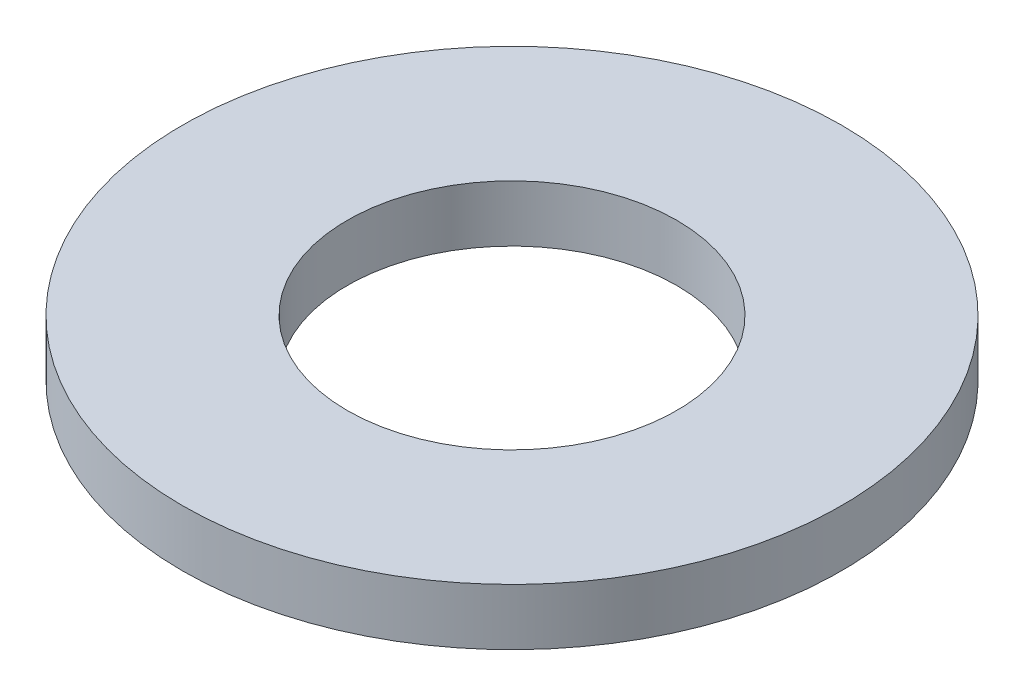
ISO-10303-21;
HEADER;
FILE_DESCRIPTION(('STEP AP214'),'2;1');
FILE_NAME('part.step','',(''),(''),'','','');
FILE_SCHEMA(('AUTOMOTIVE_DESIGN { 1 0 10303 214 1 1 1 1 }'));
ENDSEC;
DATA;
#1=APPLICATION_CONTEXT('core data for automotive mechanical design processes');
#2=APPLICATION_PROTOCOL_DEFINITION('international standard','automotive_design',2000,#1);
#3=PRODUCT_CONTEXT('',#1,'mechanical');
#4=PRODUCT('Part','Part','',(#3));
#5=PRODUCT_RELATED_PRODUCT_CATEGORY('part','',(#4));
#6=PRODUCT_DEFINITION_FORMATION('','',#4);
#7=PRODUCT_DEFINITION_CONTEXT('part definition',#1,'design');
#8=PRODUCT_DEFINITION('design','',#6,#7);
#9=PRODUCT_DEFINITION_SHAPE('','',#8);
#10=(LENGTH_UNIT() NAMED_UNIT(*) SI_UNIT(.MILLI.,.METRE.));
#11=(NAMED_UNIT(*) PLANE_ANGLE_UNIT() SI_UNIT($,.RADIAN.));
#12=(NAMED_UNIT(*) SI_UNIT($,.STERADIAN.) SOLID_ANGLE_UNIT());
#13=UNCERTAINTY_MEASURE_WITH_UNIT(LENGTH_MEASURE(1.E-05),#10,'distance_accuracy_value','');
#14=(GEOMETRIC_REPRESENTATION_CONTEXT(3) GLOBAL_UNCERTAINTY_ASSIGNED_CONTEXT((#13)) GLOBAL_UNIT_ASSIGNED_CONTEXT((#10,
#11,#12)) REPRESENTATION_CONTEXT('',''));
#15=CARTESIAN_POINT('',(0.,0.,0.));
#16=DIRECTION('',(0.,0.,1.));
#17=DIRECTION('',(1.,0.,0.));
#18=AXIS2_PLACEMENT_3D('',#15,#16,#17);
#19=CARTESIAN_POINT('',(0.,6.,0.));
#20=DIRECTION('',(0.,1.,0.));
#21=DIRECTION('',(0.,0.,1.));
#22=AXIS2_PLACEMENT_3D('',#19,#20,#21);
#23=PLANE('',#22);
#24=CARTESIAN_POINT('',(0.,6.,0.));
#25=DIRECTION('',(0.,1.,0.));
#26=DIRECTION('',(0.,0.,1.));
#27=AXIS2_PLACEMENT_3D('',#24,#25,#26);
#28=CIRCLE('',#27,35.);
#29=CARTESIAN_POINT('',(0.,6.,35.));
#30=VERTEX_POINT('',#29);
#31=EDGE_CURVE('E10',#30,#30,#28,.T.);
#32=ORIENTED_EDGE('',*,*,#31,.T.);
#33=EDGE_LOOP('',(#32));
#34=FACE_BOUND('',#33,.T.);
#35=CARTESIAN_POINT('',(0.,6.,0.));
#36=DIRECTION('',(0.,1.,0.));
#37=DIRECTION('',(0.,0.,1.));
#38=AXIS2_PLACEMENT_3D('',#35,#36,#37);
#39=CIRCLE('',#38,17.5);
#40=CARTESIAN_POINT('',(0.,6.,17.5));
#41=VERTEX_POINT('',#40);
#42=EDGE_CURVE('E40',#41,#41,#39,.T.);
#43=ORIENTED_EDGE('',*,*,#42,.F.);
#44=EDGE_LOOP('',(#43));
#45=FACE_BOUND('',#44,.T.);
#46=ADVANCED_FACE('F29',(#34,#45),#23,.T.);
#47=CARTESIAN_POINT('',(0.,0.,0.));
#48=DIRECTION('',(0.,1.,0.));
#49=DIRECTION('',(0.,0.,1.));
#50=AXIS2_PLACEMENT_3D('',#47,#48,#49);
#51=PLANE('',#50);
#52=CARTESIAN_POINT('',(0.,0.,0.));
#53=DIRECTION('',(0.,1.,0.));
#54=DIRECTION('',(0.,0.,1.));
#55=AXIS2_PLACEMENT_3D('',#52,#53,#54);
#56=CIRCLE('',#55,35.);
#57=CARTESIAN_POINT('',(0.,0.,35.));
#58=VERTEX_POINT('',#57);
#59=EDGE_CURVE('E33',#58,#58,#56,.T.);
#60=ORIENTED_EDGE('',*,*,#59,.F.);
#61=EDGE_LOOP('',(#60));
#62=FACE_BOUND('',#61,.T.);
#63=CARTESIAN_POINT('',(0.,0.,0.));
#64=DIRECTION('',(0.,1.,0.));
#65=DIRECTION('',(0.,0.,1.));
#66=AXIS2_PLACEMENT_3D('',#63,#64,#65);
#67=CIRCLE('',#66,17.5);
#68=CARTESIAN_POINT('',(0.,0.,17.5));
#69=VERTEX_POINT('',#68);
#70=EDGE_CURVE('E42',#69,#69,#67,.T.);
#71=ORIENTED_EDGE('',*,*,#70,.T.);
#72=EDGE_LOOP('',(#71));
#73=FACE_BOUND('',#72,.T.);
#74=ADVANCED_FACE('F52',(#62,#73),#51,.F.);
#75=CARTESIAN_POINT('',(0.,6.,0.));
#76=DIRECTION('',(0.,-1.,0.));
#77=DIRECTION('',(0.,0.,-1.));
#78=AXIS2_PLACEMENT_3D('',#75,#76,#77);
#79=CYLINDRICAL_SURFACE('',#78,35.);
#80=ORIENTED_EDGE('',*,*,#31,.F.);
#81=EDGE_LOOP('',(#80));
#82=FACE_BOUND('',#81,.T.);
#83=ORIENTED_EDGE('',*,*,#59,.T.);
#84=EDGE_LOOP('',(#83));
#85=FACE_BOUND('',#84,.T.);
#86=ADVANCED_FACE('F31',(#82,#85),#79,.T.);
#87=CARTESIAN_POINT('',(0.,6.,0.));
#88=DIRECTION('',(0.,-1.,0.));
#89=DIRECTION('',(0.,0.,-1.));
#90=AXIS2_PLACEMENT_3D('',#87,#88,#89);
#91=CYLINDRICAL_SURFACE('',#90,17.5);
#92=ORIENTED_EDGE('',*,*,#42,.T.);
#93=EDGE_LOOP('',(#92));
#94=FACE_BOUND('',#93,.T.);
#95=ORIENTED_EDGE('',*,*,#70,.F.);
#96=EDGE_LOOP('',(#95));
#97=FACE_BOUND('',#96,.T.);
#98=ADVANCED_FACE('F48',(#94,#97),#91,.F.);
#99=CLOSED_SHELL('',(#46,#74,#86,#98));
#100=MANIFOLD_SOLID_BREP('B2',#99);
#101=ADVANCED_BREP_SHAPE_REPRESENTATION('',(#18,#100),#14);
#102=SHAPE_DEFINITION_REPRESENTATION(#9,#101);
ENDSEC;
END-ISO-10303-21;
